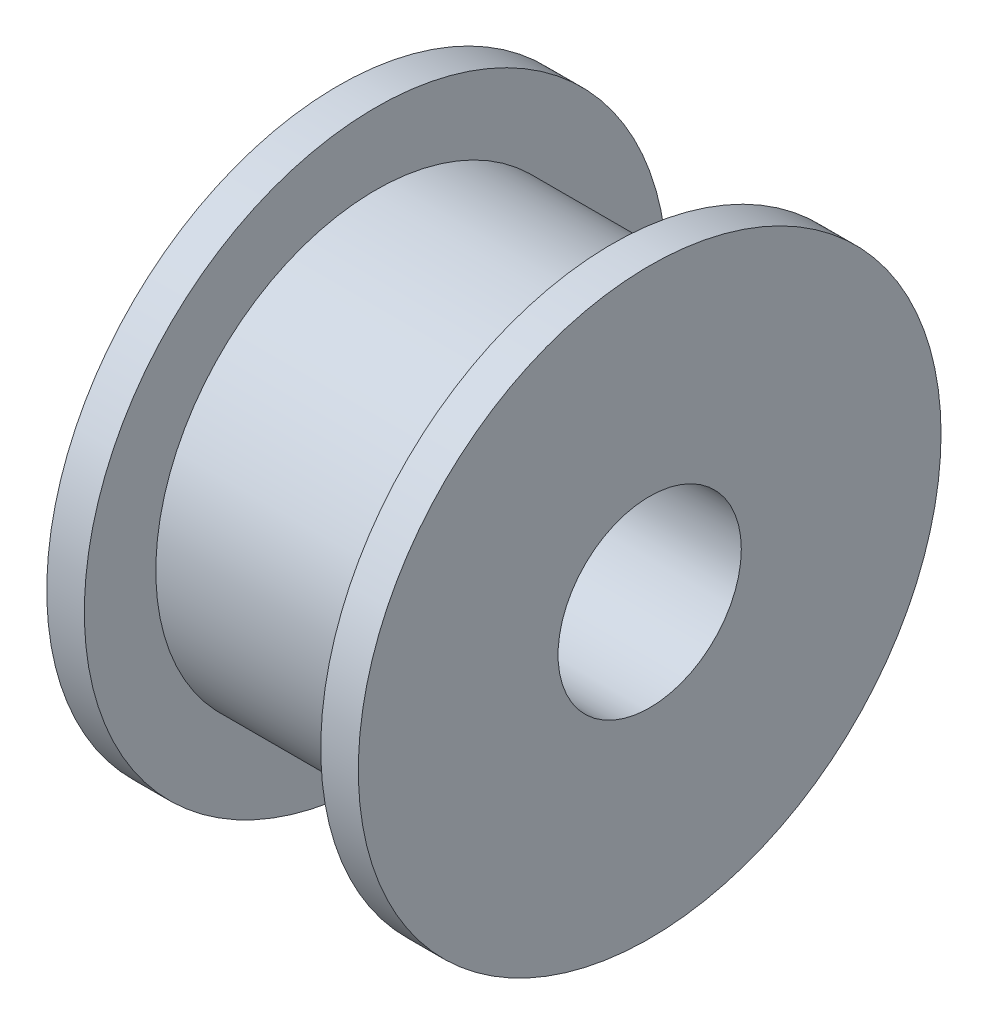
ISO-10303-21;
HEADER;
FILE_DESCRIPTION(('STEP AP214'),'2;1');
FILE_NAME('part.step','',(''),(''),'','','');
FILE_SCHEMA(('AUTOMOTIVE_DESIGN { 1 0 10303 214 1 1 1 1 }'));
ENDSEC;
DATA;
#1=APPLICATION_CONTEXT('core data for automotive mechanical design processes');
#2=APPLICATION_PROTOCOL_DEFINITION('international standard','automotive_design',2000,#1);
#3=PRODUCT_CONTEXT('',#1,'mechanical');
#4=PRODUCT('Part','Part','',(#3));
#5=PRODUCT_RELATED_PRODUCT_CATEGORY('part','',(#4));
#6=PRODUCT_DEFINITION_FORMATION('','',#4);
#7=PRODUCT_DEFINITION_CONTEXT('part definition',#1,'design');
#8=PRODUCT_DEFINITION('design','',#6,#7);
#9=PRODUCT_DEFINITION_SHAPE('','',#8);
#10=(LENGTH_UNIT() NAMED_UNIT(*) SI_UNIT(.MILLI.,.METRE.));
#11=(NAMED_UNIT(*) PLANE_ANGLE_UNIT() SI_UNIT($,.RADIAN.));
#12=(NAMED_UNIT(*) SI_UNIT($,.STERADIAN.) SOLID_ANGLE_UNIT());
#13=UNCERTAINTY_MEASURE_WITH_UNIT(LENGTH_MEASURE(1.E-05),#10,'distance_accuracy_value','');
#14=(GEOMETRIC_REPRESENTATION_CONTEXT(3) GLOBAL_UNCERTAINTY_ASSIGNED_CONTEXT((#13)) GLOBAL_UNIT_ASSIGNED_CONTEXT((#10,
#11,#12)) REPRESENTATION_CONTEXT('',''));
#15=CARTESIAN_POINT('',(0.,0.,0.));
#16=DIRECTION('',(0.,0.,1.));
#17=DIRECTION('',(1.,0.,0.));
#18=AXIS2_PLACEMENT_3D('',#15,#16,#17);
#19=CARTESIAN_POINT('',(0.,0.,0.));
#20=DIRECTION('',(1.,0.,0.));
#21=DIRECTION('',(0.,0.,-1.));
#22=AXIS2_PLACEMENT_3D('',#19,#20,#21);
#23=CYLINDRICAL_SURFACE('',#22,2.5);
#24=CARTESIAN_POINT('',(16.7688471723249,0.,0.));
#25=DIRECTION('',(1.,0.,0.));
#26=DIRECTION('',(0.,0.,-1.));
#27=AXIS2_PLACEMENT_3D('',#24,#25,#26);
#28=CIRCLE('',#27,2.5);
#29=CARTESIAN_POINT('',(16.7688471723249,0.,-2.5));
#30=VERTEX_POINT('',#29);
#31=EDGE_CURVE('E10',#30,#30,#28,.T.);
#32=ORIENTED_EDGE('',*,*,#31,.T.);
#33=EDGE_LOOP('',(#32));
#34=FACE_BOUND('',#33,.T.);
#35=CARTESIAN_POINT('',(8.26884717232492,0.,0.));
#36=DIRECTION('',(1.,0.,0.));
#37=DIRECTION('',(0.,0.,-1.));
#38=AXIS2_PLACEMENT_3D('',#35,#36,#37);
#39=CIRCLE('',#38,2.5);
#40=CARTESIAN_POINT('',(8.26884717232492,0.,-2.5));
#41=VERTEX_POINT('',#40);
#42=EDGE_CURVE('E58',#41,#41,#39,.T.);
#43=ORIENTED_EDGE('',*,*,#42,.F.);
#44=EDGE_LOOP('',(#43));
#45=FACE_BOUND('',#44,.T.);
#46=ADVANCED_FACE('F30',(#34,#45),#23,.F.);
#47=CARTESIAN_POINT('',(16.7688471723249,7.95,0.));
#48=DIRECTION('',(1.,0.,0.));
#49=DIRECTION('',(0.,0.,-1.));
#50=AXIS2_PLACEMENT_3D('',#47,#48,#49);
#51=PLANE('',#50);
#52=CARTESIAN_POINT('',(16.7688471723249,0.,0.));
#53=DIRECTION('',(1.,0.,0.));
#54=DIRECTION('',(0.,0.,-1.));
#55=AXIS2_PLACEMENT_3D('',#52,#53,#54);
#56=CIRCLE('',#55,7.95);
#57=CARTESIAN_POINT('',(16.7688471723249,0.,-7.95));
#58=VERTEX_POINT('',#57);
#59=EDGE_CURVE('E36',#58,#58,#56,.T.);
#60=ORIENTED_EDGE('',*,*,#59,.T.);
#61=EDGE_LOOP('',(#60));
#62=FACE_BOUND('',#61,.T.);
#63=ORIENTED_EDGE('',*,*,#31,.F.);
#64=EDGE_LOOP('',(#63));
#65=FACE_BOUND('',#64,.T.);
#66=ADVANCED_FACE('F66',(#62,#65),#51,.T.);
#67=CARTESIAN_POINT('',(0.,0.,0.));
#68=DIRECTION('',(1.,0.,0.));
#69=DIRECTION('',(0.,0.,-1.));
#70=AXIS2_PLACEMENT_3D('',#67,#68,#69);
#71=CYLINDRICAL_SURFACE('',#70,7.95);
#72=CARTESIAN_POINT('',(15.7438471723249,0.,0.));
#73=DIRECTION('',(1.,0.,0.));
#74=DIRECTION('',(0.,0.,-1.));
#75=AXIS2_PLACEMENT_3D('',#72,#73,#74);
#76=CIRCLE('',#75,7.95);
#77=CARTESIAN_POINT('',(15.7438471723249,0.,-7.95));
#78=VERTEX_POINT('',#77);
#79=EDGE_CURVE('E40',#78,#78,#76,.T.);
#80=ORIENTED_EDGE('',*,*,#79,.T.);
#81=EDGE_LOOP('',(#80));
#82=FACE_BOUND('',#81,.T.);
#83=ORIENTED_EDGE('',*,*,#59,.F.);
#84=EDGE_LOOP('',(#83));
#85=FACE_BOUND('',#84,.T.);
#86=ADVANCED_FACE('F70',(#82,#85),#71,.T.);
#87=CARTESIAN_POINT('',(15.7438471723249,6.,0.));
#88=DIRECTION('',(-1.,0.,0.));
#89=DIRECTION('',(0.,0.,1.));
#90=AXIS2_PLACEMENT_3D('',#87,#88,#89);
#91=PLANE('',#90);
#92=CARTESIAN_POINT('',(15.7438471723249,0.,0.));
#93=DIRECTION('',(1.,0.,0.));
#94=DIRECTION('',(0.,0.,-1.));
#95=AXIS2_PLACEMENT_3D('',#92,#93,#94);
#96=CIRCLE('',#95,6.);
#97=CARTESIAN_POINT('',(15.7438471723249,0.,-6.));
#98=VERTEX_POINT('',#97);
#99=EDGE_CURVE('E44',#98,#98,#96,.T.);
#100=ORIENTED_EDGE('',*,*,#99,.T.);
#101=EDGE_LOOP('',(#100));
#102=FACE_BOUND('',#101,.T.);
#103=ORIENTED_EDGE('',*,*,#79,.F.);
#104=EDGE_LOOP('',(#103));
#105=FACE_BOUND('',#104,.T.);
#106=ADVANCED_FACE('F74',(#102,#105),#91,.T.);
#107=CARTESIAN_POINT('',(0.,0.,0.));
#108=DIRECTION('',(1.,0.,0.));
#109=DIRECTION('',(0.,0.,-1.));
#110=AXIS2_PLACEMENT_3D('',#107,#108,#109);
#111=CYLINDRICAL_SURFACE('',#110,6.);
#112=CARTESIAN_POINT('',(9.29384717232492,0.,0.));
#113=DIRECTION('',(1.,0.,0.));
#114=DIRECTION('',(0.,0.,-1.));
#115=AXIS2_PLACEMENT_3D('',#112,#113,#114);
#116=CIRCLE('',#115,6.);
#117=CARTESIAN_POINT('',(9.29384717232492,0.,-6.));
#118=VERTEX_POINT('',#117);
#119=EDGE_CURVE('E49',#118,#118,#116,.T.);
#120=ORIENTED_EDGE('',*,*,#119,.T.);
#121=EDGE_LOOP('',(#120));
#122=FACE_BOUND('',#121,.T.);
#123=ORIENTED_EDGE('',*,*,#99,.F.);
#124=EDGE_LOOP('',(#123));
#125=FACE_BOUND('',#124,.T.);
#126=ADVANCED_FACE('F81',(#122,#125),#111,.T.);
#127=CARTESIAN_POINT('',(9.29384717232492,7.95,0.));
#128=DIRECTION('',(1.,0.,0.));
#129=DIRECTION('',(0.,0.,-1.));
#130=AXIS2_PLACEMENT_3D('',#127,#128,#129);
#131=PLANE('',#130);
#132=CARTESIAN_POINT('',(9.29384717232492,0.,0.));
#133=DIRECTION('',(1.,0.,0.));
#134=DIRECTION('',(0.,0.,-1.));
#135=AXIS2_PLACEMENT_3D('',#132,#133,#134);
#136=CIRCLE('',#135,7.95);
#137=CARTESIAN_POINT('',(9.29384717232492,0.,-7.95));
#138=VERTEX_POINT('',#137);
#139=EDGE_CURVE('E52',#138,#138,#136,.T.);
#140=ORIENTED_EDGE('',*,*,#139,.T.);
#141=EDGE_LOOP('',(#140));
#142=FACE_BOUND('',#141,.T.);
#143=ORIENTED_EDGE('',*,*,#119,.F.);
#144=EDGE_LOOP('',(#143));
#145=FACE_BOUND('',#144,.T.);
#146=ADVANCED_FACE('F85',(#142,#145),#131,.T.);
#147=CARTESIAN_POINT('',(0.,0.,0.));
#148=DIRECTION('',(1.,0.,0.));
#149=DIRECTION('',(0.,0.,-1.));
#150=AXIS2_PLACEMENT_3D('',#147,#148,#149);
#151=CYLINDRICAL_SURFACE('',#150,7.95);
#152=CARTESIAN_POINT('',(8.26884717232492,0.,0.));
#153=DIRECTION('',(1.,0.,0.));
#154=DIRECTION('',(0.,0.,-1.));
#155=AXIS2_PLACEMENT_3D('',#152,#153,#154);
#156=CIRCLE('',#155,7.95);
#157=CARTESIAN_POINT('',(8.26884717232492,0.,-7.95));
#158=VERTEX_POINT('',#157);
#159=EDGE_CURVE('E55',#158,#158,#156,.T.);
#160=ORIENTED_EDGE('',*,*,#159,.T.);
#161=EDGE_LOOP('',(#160));
#162=FACE_BOUND('',#161,.T.);
#163=ORIENTED_EDGE('',*,*,#139,.F.);
#164=EDGE_LOOP('',(#163));
#165=FACE_BOUND('',#164,.T.);
#166=ADVANCED_FACE('F89',(#162,#165),#151,.T.);
#167=CARTESIAN_POINT('',(8.26884717232492,7.95,0.));
#168=DIRECTION('',(-1.,0.,0.));
#169=DIRECTION('',(0.,0.,1.));
#170=AXIS2_PLACEMENT_3D('',#167,#168,#169);
#171=PLANE('',#170);
#172=ORIENTED_EDGE('',*,*,#42,.T.);
#173=EDGE_LOOP('',(#172));
#174=FACE_BOUND('',#173,.T.);
#175=ORIENTED_EDGE('',*,*,#159,.F.);
#176=EDGE_LOOP('',(#175));
#177=FACE_BOUND('',#176,.T.);
#178=ADVANCED_FACE('F62',(#174,#177),#171,.T.);
#179=CLOSED_SHELL('',(#46,#66,#86,#106,#126,#146,#166,#178));
#180=MANIFOLD_SOLID_BREP('B2',#179);
#181=ADVANCED_BREP_SHAPE_REPRESENTATION('',(#18,#180),#14);
#182=SHAPE_DEFINITION_REPRESENTATION(#9,#181);
ENDSEC;
END-ISO-10303-21;
